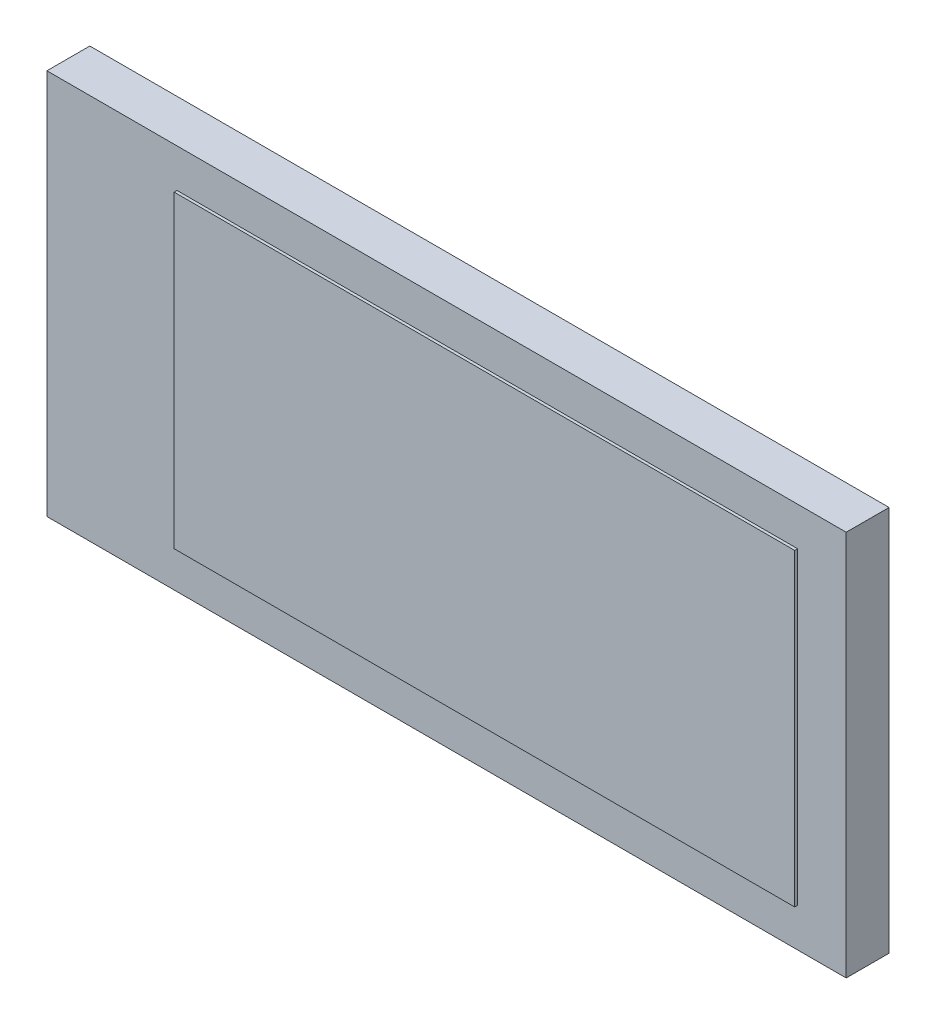
ISO-10303-21;
HEADER;
FILE_DESCRIPTION(('STEP AP214'),'2;1');
FILE_NAME('part.step','',(''),(''),'','','');
FILE_SCHEMA(('AUTOMOTIVE_DESIGN { 1 0 10303 214 1 1 1 1 }'));
ENDSEC;
DATA;
#1=APPLICATION_CONTEXT('core data for automotive mechanical design processes');
#2=APPLICATION_PROTOCOL_DEFINITION('international standard','automotive_design',2000,#1);
#3=PRODUCT_CONTEXT('',#1,'mechanical');
#4=PRODUCT('Part','Part','',(#3));
#5=PRODUCT_RELATED_PRODUCT_CATEGORY('part','',(#4));
#6=PRODUCT_DEFINITION_FORMATION('','',#4);
#7=PRODUCT_DEFINITION_CONTEXT('part definition',#1,'design');
#8=PRODUCT_DEFINITION('design','',#6,#7);
#9=PRODUCT_DEFINITION_SHAPE('','',#8);
#10=(LENGTH_UNIT() NAMED_UNIT(*) SI_UNIT(.MILLI.,.METRE.));
#11=(NAMED_UNIT(*) PLANE_ANGLE_UNIT() SI_UNIT($,.RADIAN.));
#12=(NAMED_UNIT(*) SI_UNIT($,.STERADIAN.) SOLID_ANGLE_UNIT());
#13=UNCERTAINTY_MEASURE_WITH_UNIT(LENGTH_MEASURE(1.E-05),#10,'distance_accuracy_value','');
#14=(GEOMETRIC_REPRESENTATION_CONTEXT(3) GLOBAL_UNCERTAINTY_ASSIGNED_CONTEXT((#13)) GLOBAL_UNIT_ASSIGNED_CONTEXT((#10,
#11,#12)) REPRESENTATION_CONTEXT('',''));
#15=CARTESIAN_POINT('',(0.,0.,0.));
#16=DIRECTION('',(0.,0.,1.));
#17=DIRECTION('',(1.,0.,0.));
#18=AXIS2_PLACEMENT_3D('',#15,#16,#17);
#19=CARTESIAN_POINT('',(0.,0.,1.5));
#20=DIRECTION('',(1.,0.,0.));
#21=DIRECTION('',(0.,1.,0.));
#22=AXIS2_PLACEMENT_3D('',#19,#20,#21);
#23=PLANE('',#22);
#24=DIRECTION('',(0.,-1.,0.));
#25=VECTOR('',#24,1.);
#26=CARTESIAN_POINT('',(0.,0.,0.));
#27=LINE('',#26,#25);
#28=CARTESIAN_POINT('',(0.,0.,0.));
#29=VERTEX_POINT('',#28);
#30=CARTESIAN_POINT('',(0.,-13.5,0.));
#31=VERTEX_POINT('',#30);
#32=EDGE_CURVE('E123',#29,#31,#27,.T.);
#33=ORIENTED_EDGE('',*,*,#32,.T.);
#34=DIRECTION('',(0.,0.,-1.));
#35=VECTOR('',#34,1.);
#36=CARTESIAN_POINT('',(0.,-13.5,1.5));
#37=LINE('',#36,#35);
#38=CARTESIAN_POINT('',(0.,-13.5,1.5));
#39=VERTEX_POINT('',#38);
#40=EDGE_CURVE('E11',#39,#31,#37,.T.);
#41=ORIENTED_EDGE('',*,*,#40,.F.);
#42=DIRECTION('',(0.,-1.,0.));
#43=VECTOR('',#42,1.);
#44=CARTESIAN_POINT('',(0.,0.,1.5));
#45=LINE('',#44,#43);
#46=CARTESIAN_POINT('',(0.,0.,1.5));
#47=VERTEX_POINT('',#46);
#48=EDGE_CURVE('E132',#47,#39,#45,.T.);
#49=ORIENTED_EDGE('',*,*,#48,.F.);
#50=DIRECTION('',(0.,0.,-1.));
#51=VECTOR('',#50,1.);
#52=CARTESIAN_POINT('',(0.,0.,1.5));
#53=LINE('',#52,#51);
#54=EDGE_CURVE('E141',#47,#29,#53,.T.);
#55=ORIENTED_EDGE('',*,*,#54,.T.);
#56=EDGE_LOOP('',(#33,#41,#49,#55));
#57=FACE_BOUND('',#56,.T.);
#58=ADVANCED_FACE('F38',(#57),#23,.F.);
#59=CARTESIAN_POINT('',(0.,-13.5,1.5));
#60=DIRECTION('',(0.,1.,0.));
#61=DIRECTION('',(0.,0.,1.));
#62=AXIS2_PLACEMENT_3D('',#59,#60,#61);
#63=PLANE('',#62);
#64=DIRECTION('',(1.,0.,0.));
#65=VECTOR('',#64,1.);
#66=CARTESIAN_POINT('',(0.,-13.5,0.));
#67=LINE('',#66,#65);
#68=CARTESIAN_POINT('',(27.95,-13.5,0.));
#69=VERTEX_POINT('',#68);
#70=EDGE_CURVE('E126',#31,#69,#67,.T.);
#71=ORIENTED_EDGE('',*,*,#70,.T.);
#72=DIRECTION('',(0.,0.,-1.));
#73=VECTOR('',#72,1.);
#74=CARTESIAN_POINT('',(27.95,-13.5,1.5));
#75=LINE('',#74,#73);
#76=CARTESIAN_POINT('',(27.95,-13.5,1.5));
#77=VERTEX_POINT('',#76);
#78=EDGE_CURVE('E45',#77,#69,#75,.T.);
#79=ORIENTED_EDGE('',*,*,#78,.F.);
#80=DIRECTION('',(1.,0.,0.));
#81=VECTOR('',#80,1.);
#82=CARTESIAN_POINT('',(0.,-13.5,1.5));
#83=LINE('',#82,#81);
#84=EDGE_CURVE('E135',#39,#77,#83,.T.);
#85=ORIENTED_EDGE('',*,*,#84,.F.);
#86=ORIENTED_EDGE('',*,*,#40,.T.);
#87=EDGE_LOOP('',(#71,#79,#85,#86));
#88=FACE_BOUND('',#87,.T.);
#89=ADVANCED_FACE('F172',(#88),#63,.F.);
#90=CARTESIAN_POINT('',(27.95,0.,1.5));
#91=DIRECTION('',(-1.,0.,0.));
#92=DIRECTION('',(0.,0.,1.));
#93=AXIS2_PLACEMENT_3D('',#90,#91,#92);
#94=PLANE('',#93);
#95=DIRECTION('',(0.,1.,0.));
#96=VECTOR('',#95,1.);
#97=CARTESIAN_POINT('',(27.95,0.,0.));
#98=LINE('',#97,#96);
#99=CARTESIAN_POINT('',(27.95,0.,0.));
#100=VERTEX_POINT('',#99);
#101=EDGE_CURVE('E144',#69,#100,#98,.T.);
#102=ORIENTED_EDGE('',*,*,#101,.T.);
#103=DIRECTION('',(0.,0.,-1.));
#104=VECTOR('',#103,1.);
#105=CARTESIAN_POINT('',(27.95,0.,1.5));
#106=LINE('',#105,#104);
#107=CARTESIAN_POINT('',(27.95,0.,1.5));
#108=VERTEX_POINT('',#107);
#109=EDGE_CURVE('E149',#108,#100,#106,.T.);
#110=ORIENTED_EDGE('',*,*,#109,.F.);
#111=DIRECTION('',(0.,1.,0.));
#112=VECTOR('',#111,1.);
#113=CARTESIAN_POINT('',(27.95,0.,1.5));
#114=LINE('',#113,#112);
#115=EDGE_CURVE('E138',#77,#108,#114,.T.);
#116=ORIENTED_EDGE('',*,*,#115,.F.);
#117=ORIENTED_EDGE('',*,*,#78,.T.);
#118=EDGE_LOOP('',(#102,#110,#116,#117));
#119=FACE_BOUND('',#118,.T.);
#120=ADVANCED_FACE('F156',(#119),#94,.F.);
#121=CARTESIAN_POINT('',(0.,0.,1.5));
#122=DIRECTION('',(0.,-1.,0.));
#123=DIRECTION('',(0.,0.,-1.));
#124=AXIS2_PLACEMENT_3D('',#121,#122,#123);
#125=PLANE('',#124);
#126=DIRECTION('',(-1.,0.,0.));
#127=VECTOR('',#126,1.);
#128=CARTESIAN_POINT('',(0.,0.,0.));
#129=LINE('',#128,#127);
#130=EDGE_CURVE('E136',#100,#29,#129,.T.);
#131=ORIENTED_EDGE('',*,*,#130,.T.);
#132=ORIENTED_EDGE('',*,*,#54,.F.);
#133=DIRECTION('',(-1.,0.,0.));
#134=VECTOR('',#133,1.);
#135=CARTESIAN_POINT('',(0.,0.,1.5));
#136=LINE('',#135,#134);
#137=EDGE_CURVE('E140',#108,#47,#136,.T.);
#138=ORIENTED_EDGE('',*,*,#137,.F.);
#139=ORIENTED_EDGE('',*,*,#109,.T.);
#140=EDGE_LOOP('',(#131,#132,#138,#139));
#141=FACE_BOUND('',#140,.T.);
#142=ADVANCED_FACE('F165',(#141),#125,.F.);
#143=CARTESIAN_POINT('',(0.,0.,1.5));
#144=DIRECTION('',(0.,0.,1.));
#145=DIRECTION('',(1.,0.,0.));
#146=AXIS2_PLACEMENT_3D('',#143,#144,#145);
#147=PLANE('',#146);
#148=DIRECTION('',(1.,0.,0.));
#149=VECTOR('',#148,1.);
#150=CARTESIAN_POINT('',(4.55,-12.15,1.5));
#151=LINE('',#150,#149);
#152=CARTESIAN_POINT('',(4.55,-12.15,1.5));
#153=VERTEX_POINT('',#152);
#154=CARTESIAN_POINT('',(26.25,-12.15,1.5));
#155=VERTEX_POINT('',#154);
#156=EDGE_CURVE('E52',#153,#155,#151,.T.);
#157=ORIENTED_EDGE('',*,*,#156,.F.);
#158=DIRECTION('',(0.,1.,0.));
#159=VECTOR('',#158,1.);
#160=CARTESIAN_POINT('',(4.55,-12.15,1.5));
#161=LINE('',#160,#159);
#162=CARTESIAN_POINT('',(4.55,-1.35,1.5));
#163=VERTEX_POINT('',#162);
#164=EDGE_CURVE('E57',#153,#163,#161,.T.);
#165=ORIENTED_EDGE('',*,*,#164,.T.);
#166=DIRECTION('',(1.,0.,0.));
#167=VECTOR('',#166,1.);
#168=CARTESIAN_POINT('',(4.55,-1.35,1.5));
#169=LINE('',#168,#167);
#170=CARTESIAN_POINT('',(26.25,-1.35,1.5));
#171=VERTEX_POINT('',#170);
#172=EDGE_CURVE('E269',#163,#171,#169,.T.);
#173=ORIENTED_EDGE('',*,*,#172,.T.);
#174=DIRECTION('',(0.,1.,0.));
#175=VECTOR('',#174,1.);
#176=CARTESIAN_POINT('',(26.25,-12.15,1.5));
#177=LINE('',#176,#175);
#178=EDGE_CURVE('E271',#155,#171,#177,.T.);
#179=ORIENTED_EDGE('',*,*,#178,.F.);
#180=EDGE_LOOP('',(#157,#165,#173,#179));
#181=FACE_BOUND('',#180,.T.);
#182=ORIENTED_EDGE('',*,*,#48,.T.);
#183=ORIENTED_EDGE('',*,*,#84,.T.);
#184=ORIENTED_EDGE('',*,*,#115,.T.);
#185=ORIENTED_EDGE('',*,*,#137,.T.);
#186=EDGE_LOOP('',(#182,#183,#184,#185));
#187=FACE_BOUND('',#186,.T.);
#188=ADVANCED_FACE('F171',(#181,#187),#147,.T.);
#189=CARTESIAN_POINT('',(0.,0.,0.));
#190=DIRECTION('',(0.,0.,1.));
#191=DIRECTION('',(1.,0.,0.));
#192=AXIS2_PLACEMENT_3D('',#189,#190,#191);
#193=PLANE('',#192);
#194=ORIENTED_EDGE('',*,*,#32,.F.);
#195=ORIENTED_EDGE('',*,*,#130,.F.);
#196=ORIENTED_EDGE('',*,*,#101,.F.);
#197=ORIENTED_EDGE('',*,*,#70,.F.);
#198=EDGE_LOOP('',(#194,#195,#196,#197));
#199=FACE_BOUND('',#198,.T.);
#200=ADVANCED_FACE('F162',(#199),#193,.F.);
#201=CARTESIAN_POINT('',(4.55,-12.15,1.6));
#202=DIRECTION('',(0.,1.,0.));
#203=DIRECTION('',(0.,0.,1.));
#204=AXIS2_PLACEMENT_3D('',#201,#202,#203);
#205=PLANE('',#204);
#206=ORIENTED_EDGE('',*,*,#156,.T.);
#207=DIRECTION('',(0.,0.,-1.));
#208=VECTOR('',#207,1.);
#209=CARTESIAN_POINT('',(26.25,-12.15,1.6));
#210=LINE('',#209,#208);
#211=CARTESIAN_POINT('',(26.25,-12.15,1.6));
#212=VERTEX_POINT('',#211);
#213=EDGE_CURVE('E106',#212,#155,#210,.T.);
#214=ORIENTED_EDGE('',*,*,#213,.F.);
#215=DIRECTION('',(1.,0.,0.));
#216=VECTOR('',#215,1.);
#217=CARTESIAN_POINT('',(4.55,-12.15,1.6));
#218=LINE('',#217,#216);
#219=CARTESIAN_POINT('',(4.55,-12.15,1.6));
#220=VERTEX_POINT('',#219);
#221=EDGE_CURVE('E113',#220,#212,#218,.T.);
#222=ORIENTED_EDGE('',*,*,#221,.F.);
#223=DIRECTION('',(0.,0.,-1.));
#224=VECTOR('',#223,1.);
#225=CARTESIAN_POINT('',(4.55,-12.15,1.6));
#226=LINE('',#225,#224);
#227=EDGE_CURVE('E267',#220,#153,#226,.T.);
#228=ORIENTED_EDGE('',*,*,#227,.T.);
#229=EDGE_LOOP('',(#206,#214,#222,#228));
#230=FACE_BOUND('',#229,.T.);
#231=ADVANCED_FACE('F122',(#230),#205,.F.);
#232=CARTESIAN_POINT('',(26.25,-12.15,1.6));
#233=DIRECTION('',(-1.,0.,0.));
#234=DIRECTION('',(0.,0.,1.));
#235=AXIS2_PLACEMENT_3D('',#232,#233,#234);
#236=PLANE('',#235);
#237=ORIENTED_EDGE('',*,*,#178,.T.);
#238=DIRECTION('',(0.,0.,-1.));
#239=VECTOR('',#238,1.);
#240=CARTESIAN_POINT('',(26.25,-1.35,1.6));
#241=LINE('',#240,#239);
#242=CARTESIAN_POINT('',(26.25,-1.35,1.6));
#243=VERTEX_POINT('',#242);
#244=EDGE_CURVE('E108',#243,#171,#241,.T.);
#245=ORIENTED_EDGE('',*,*,#244,.F.);
#246=DIRECTION('',(0.,1.,0.));
#247=VECTOR('',#246,1.);
#248=CARTESIAN_POINT('',(26.25,-12.15,1.6));
#249=LINE('',#248,#247);
#250=EDGE_CURVE('E101',#212,#243,#249,.T.);
#251=ORIENTED_EDGE('',*,*,#250,.F.);
#252=ORIENTED_EDGE('',*,*,#213,.T.);
#253=EDGE_LOOP('',(#237,#245,#251,#252));
#254=FACE_BOUND('',#253,.T.);
#255=ADVANCED_FACE('F104',(#254),#236,.F.);
#256=CARTESIAN_POINT('',(4.55,-1.35,1.6));
#257=DIRECTION('',(0.,1.,0.));
#258=DIRECTION('',(-1.,0.,0.));
#259=AXIS2_PLACEMENT_3D('',#256,#257,#258);
#260=PLANE('',#259);
#261=ORIENTED_EDGE('',*,*,#172,.F.);
#262=DIRECTION('',(0.,0.,-1.));
#263=VECTOR('',#262,1.);
#264=CARTESIAN_POINT('',(4.55,-1.35,1.6));
#265=LINE('',#264,#263);
#266=CARTESIAN_POINT('',(4.55,-1.35,1.6));
#267=VERTEX_POINT('',#266);
#268=EDGE_CURVE('E128',#267,#163,#265,.T.);
#269=ORIENTED_EDGE('',*,*,#268,.F.);
#270=DIRECTION('',(1.,0.,0.));
#271=VECTOR('',#270,1.);
#272=CARTESIAN_POINT('',(4.55,-1.35,1.6));
#273=LINE('',#272,#271);
#274=EDGE_CURVE('E112',#267,#243,#273,.T.);
#275=ORIENTED_EDGE('',*,*,#274,.T.);
#276=ORIENTED_EDGE('',*,*,#244,.T.);
#277=EDGE_LOOP('',(#261,#269,#275,#276));
#278=FACE_BOUND('',#277,.T.);
#279=ADVANCED_FACE('F190',(#278),#260,.T.);
#280=CARTESIAN_POINT('',(4.55,-12.15,1.6));
#281=DIRECTION('',(-1.,0.,0.));
#282=DIRECTION('',(0.,-1.,0.));
#283=AXIS2_PLACEMENT_3D('',#280,#281,#282);
#284=PLANE('',#283);
#285=ORIENTED_EDGE('',*,*,#164,.F.);
#286=ORIENTED_EDGE('',*,*,#227,.F.);
#287=DIRECTION('',(0.,1.,0.));
#288=VECTOR('',#287,1.);
#289=CARTESIAN_POINT('',(4.55,-12.15,1.6));
#290=LINE('',#289,#288);
#291=EDGE_CURVE('E119',#220,#267,#290,.T.);
#292=ORIENTED_EDGE('',*,*,#291,.T.);
#293=ORIENTED_EDGE('',*,*,#268,.T.);
#294=EDGE_LOOP('',(#285,#286,#292,#293));
#295=FACE_BOUND('',#294,.T.);
#296=ADVANCED_FACE('F193',(#295),#284,.T.);
#297=CARTESIAN_POINT('',(0.,0.,1.6));
#298=DIRECTION('',(0.,0.,1.));
#299=DIRECTION('',(1.,0.,0.));
#300=AXIS2_PLACEMENT_3D('',#297,#298,#299);
#301=PLANE('',#300);
#302=ORIENTED_EDGE('',*,*,#221,.T.);
#303=ORIENTED_EDGE('',*,*,#250,.T.);
#304=ORIENTED_EDGE('',*,*,#274,.F.);
#305=ORIENTED_EDGE('',*,*,#291,.F.);
#306=EDGE_LOOP('',(#302,#303,#304,#305));
#307=FACE_BOUND('',#306,.T.);
#308=ADVANCED_FACE('F117',(#307),#301,.T.);
#309=CLOSED_SHELL('',(#58,#89,#120,#142,#188,#200,#231,#255,#279,#296,#308));
#310=MANIFOLD_SOLID_BREP('B2',#309);
#311=ADVANCED_BREP_SHAPE_REPRESENTATION('',(#18,#310),#14);
#312=SHAPE_DEFINITION_REPRESENTATION(#9,#311);
ENDSEC;
END-ISO-10303-21;
